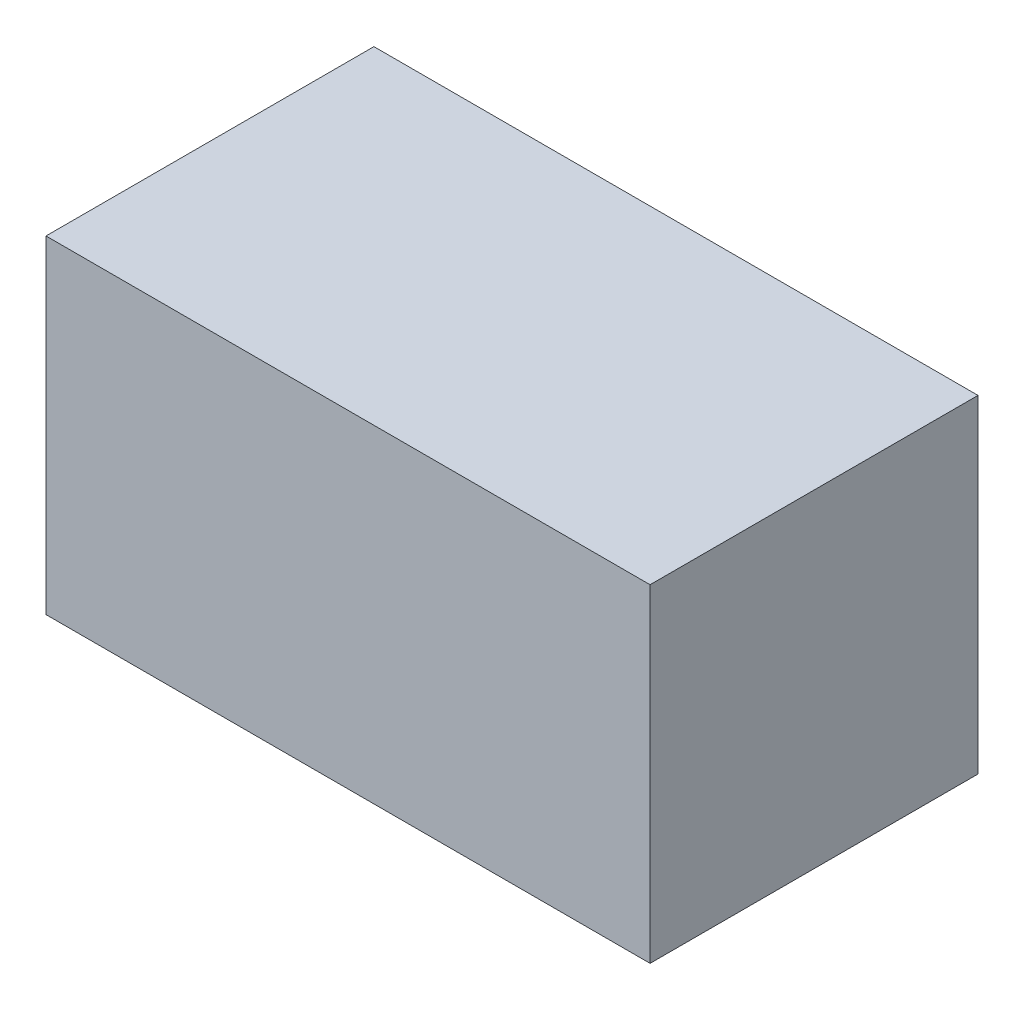
ISO-10303-21;
HEADER;
FILE_DESCRIPTION(('STEP AP214'),'2;1');
FILE_NAME('part.step','',(''),(''),'','','');
FILE_SCHEMA(('AUTOMOTIVE_DESIGN { 1 0 10303 214 1 1 1 1 }'));
ENDSEC;
DATA;
#1=APPLICATION_CONTEXT('core data for automotive mechanical design processes');
#2=APPLICATION_PROTOCOL_DEFINITION('international standard','automotive_design',2000,#1);
#3=PRODUCT_CONTEXT('',#1,'mechanical');
#4=PRODUCT('Part','Part','',(#3));
#5=PRODUCT_RELATED_PRODUCT_CATEGORY('part','',(#4));
#6=PRODUCT_DEFINITION_FORMATION('','',#4);
#7=PRODUCT_DEFINITION_CONTEXT('part definition',#1,'design');
#8=PRODUCT_DEFINITION('design','',#6,#7);
#9=PRODUCT_DEFINITION_SHAPE('','',#8);
#10=(LENGTH_UNIT() NAMED_UNIT(*) SI_UNIT(.MILLI.,.METRE.));
#11=(NAMED_UNIT(*) PLANE_ANGLE_UNIT() SI_UNIT($,.RADIAN.));
#12=(NAMED_UNIT(*) SI_UNIT($,.STERADIAN.) SOLID_ANGLE_UNIT());
#13=UNCERTAINTY_MEASURE_WITH_UNIT(LENGTH_MEASURE(1.E-05),#10,'distance_accuracy_value','');
#14=(GEOMETRIC_REPRESENTATION_CONTEXT(3) GLOBAL_UNCERTAINTY_ASSIGNED_CONTEXT((#13)) GLOBAL_UNIT_ASSIGNED_CONTEXT((#10,
#11,#12)) REPRESENTATION_CONTEXT('',''));
#15=CARTESIAN_POINT('',(0.,0.,0.));
#16=DIRECTION('',(0.,0.,1.));
#17=DIRECTION('',(1.,0.,0.));
#18=AXIS2_PLACEMENT_3D('',#15,#16,#17);
#19=CARTESIAN_POINT('',(0.87500206,-0.47500032,0.));
#20=DIRECTION('',(-1.,0.,0.));
#21=DIRECTION('',(0.,1.,0.));
#22=AXIS2_PLACEMENT_3D('',#19,#20,#21);
#23=PLANE('',#22);
#24=DIRECTION('',(0.,1.,0.));
#25=VECTOR('',#24,1.);
#26=CARTESIAN_POINT('',(0.87500206,-0.47500032,0.));
#27=LINE('',#26,#25);
#28=CARTESIAN_POINT('',(0.87500206,-0.47500032,0.));
#29=VERTEX_POINT('',#28);
#30=CARTESIAN_POINT('',(0.87500206,0.47500032,0.));
#31=VERTEX_POINT('',#30);
#32=EDGE_CURVE('E11',#29,#31,#27,.T.);
#33=ORIENTED_EDGE('',*,*,#32,.T.);
#34=DIRECTION('',(0.,0.,1.));
#35=VECTOR('',#34,1.);
#36=CARTESIAN_POINT('',(0.87500206,0.47500032,0.));
#37=LINE('',#36,#35);
#38=CARTESIAN_POINT('',(0.87500206,0.47500032,0.95000064));
#39=VERTEX_POINT('',#38);
#40=EDGE_CURVE('E24',#31,#39,#37,.T.);
#41=ORIENTED_EDGE('',*,*,#40,.T.);
#42=DIRECTION('',(0.,1.,0.));
#43=VECTOR('',#42,1.);
#44=CARTESIAN_POINT('',(0.87500206,-0.47500032,0.95000064));
#45=LINE('',#44,#43);
#46=CARTESIAN_POINT('',(0.87500206,-0.47500032,0.95000064));
#47=VERTEX_POINT('',#46);
#48=EDGE_CURVE('E87',#47,#39,#45,.T.);
#49=ORIENTED_EDGE('',*,*,#48,.F.);
#50=DIRECTION('',(0.,0.,1.));
#51=VECTOR('',#50,1.);
#52=CARTESIAN_POINT('',(0.87500206,-0.47500032,0.));
#53=LINE('',#52,#51);
#54=EDGE_CURVE('E36',#29,#47,#53,.T.);
#55=ORIENTED_EDGE('',*,*,#54,.F.);
#56=EDGE_LOOP('',(#33,#41,#49,#55));
#57=FACE_BOUND('',#56,.T.);
#58=ADVANCED_FACE('F17',(#57),#23,.F.);
#59=CARTESIAN_POINT('',(0.87500206,0.47500032,0.));
#60=DIRECTION('',(0.,-1.,0.));
#61=DIRECTION('',(-1.,0.,0.));
#62=AXIS2_PLACEMENT_3D('',#59,#60,#61);
#63=PLANE('',#62);
#64=DIRECTION('',(-1.,0.,0.));
#65=VECTOR('',#64,1.);
#66=CARTESIAN_POINT('',(0.87500206,0.47500032,0.));
#67=LINE('',#66,#65);
#68=CARTESIAN_POINT('',(-0.87499952,0.47500032,0.));
#69=VERTEX_POINT('',#68);
#70=EDGE_CURVE('E84',#31,#69,#67,.T.);
#71=ORIENTED_EDGE('',*,*,#70,.T.);
#72=DIRECTION('',(0.,0.,1.));
#73=VECTOR('',#72,1.);
#74=CARTESIAN_POINT('',(-0.87499952,0.47500032,0.));
#75=LINE('',#74,#73);
#76=CARTESIAN_POINT('',(-0.87499952,0.47500032,0.95000064));
#77=VERTEX_POINT('',#76);
#78=EDGE_CURVE('E82',#69,#77,#75,.T.);
#79=ORIENTED_EDGE('',*,*,#78,.T.);
#80=DIRECTION('',(-1.,0.,0.));
#81=VECTOR('',#80,1.);
#82=CARTESIAN_POINT('',(0.87500206,0.47500032,0.95000064));
#83=LINE('',#82,#81);
#84=EDGE_CURVE('E62',#39,#77,#83,.T.);
#85=ORIENTED_EDGE('',*,*,#84,.F.);
#86=ORIENTED_EDGE('',*,*,#40,.F.);
#87=EDGE_LOOP('',(#71,#79,#85,#86));
#88=FACE_BOUND('',#87,.T.);
#89=ADVANCED_FACE('F89',(#88),#63,.F.);
#90=CARTESIAN_POINT('',(-0.87499952,0.47500032,0.));
#91=DIRECTION('',(1.,0.,0.));
#92=DIRECTION('',(0.,-1.,0.));
#93=AXIS2_PLACEMENT_3D('',#90,#91,#92);
#94=PLANE('',#93);
#95=DIRECTION('',(0.,-1.,0.));
#96=VECTOR('',#95,1.);
#97=CARTESIAN_POINT('',(-0.87499952,0.47500032,0.));
#98=LINE('',#97,#96);
#99=CARTESIAN_POINT('',(-0.87499952,-0.47500032,0.));
#100=VERTEX_POINT('',#99);
#101=EDGE_CURVE('E71',#69,#100,#98,.T.);
#102=ORIENTED_EDGE('',*,*,#101,.T.);
#103=DIRECTION('',(0.,0.,1.));
#104=VECTOR('',#103,1.);
#105=CARTESIAN_POINT('',(-0.87499952,-0.47500032,0.));
#106=LINE('',#105,#104);
#107=CARTESIAN_POINT('',(-0.87499952,-0.47500032,0.95000064));
#108=VERTEX_POINT('',#107);
#109=EDGE_CURVE('E65',#100,#108,#106,.T.);
#110=ORIENTED_EDGE('',*,*,#109,.T.);
#111=DIRECTION('',(0.,-1.,0.));
#112=VECTOR('',#111,1.);
#113=CARTESIAN_POINT('',(-0.87499952,0.47500032,0.95000064));
#114=LINE('',#113,#112);
#115=EDGE_CURVE('E57',#77,#108,#114,.T.);
#116=ORIENTED_EDGE('',*,*,#115,.F.);
#117=ORIENTED_EDGE('',*,*,#78,.F.);
#118=EDGE_LOOP('',(#102,#110,#116,#117));
#119=FACE_BOUND('',#118,.T.);
#120=ADVANCED_FACE('F69',(#119),#94,.F.);
#121=CARTESIAN_POINT('',(-0.87499952,-0.47500032,0.));
#122=DIRECTION('',(0.,1.,0.));
#123=DIRECTION('',(1.,0.,0.));
#124=AXIS2_PLACEMENT_3D('',#121,#122,#123);
#125=PLANE('',#124);
#126=DIRECTION('',(1.,0.,0.));
#127=VECTOR('',#126,1.);
#128=CARTESIAN_POINT('',(-0.87499952,-0.47500032,0.));
#129=LINE('',#128,#127);
#130=EDGE_CURVE('E66',#100,#29,#129,.T.);
#131=ORIENTED_EDGE('',*,*,#130,.T.);
#132=ORIENTED_EDGE('',*,*,#54,.T.);
#133=DIRECTION('',(1.,0.,0.));
#134=VECTOR('',#133,1.);
#135=CARTESIAN_POINT('',(-0.87499952,-0.47500032,0.95000064));
#136=LINE('',#135,#134);
#137=EDGE_CURVE('E61',#108,#47,#136,.T.);
#138=ORIENTED_EDGE('',*,*,#137,.F.);
#139=ORIENTED_EDGE('',*,*,#109,.F.);
#140=EDGE_LOOP('',(#131,#132,#138,#139));
#141=FACE_BOUND('',#140,.T.);
#142=ADVANCED_FACE('F76',(#141),#125,.F.);
#143=CARTESIAN_POINT('',(0.87500206,-0.47500032,0.));
#144=DIRECTION('',(0.,0.,-1.));
#145=DIRECTION('',(-1.,0.,0.));
#146=AXIS2_PLACEMENT_3D('',#143,#144,#145);
#147=PLANE('',#146);
#148=ORIENTED_EDGE('',*,*,#130,.F.);
#149=ORIENTED_EDGE('',*,*,#101,.F.);
#150=ORIENTED_EDGE('',*,*,#70,.F.);
#151=ORIENTED_EDGE('',*,*,#32,.F.);
#152=EDGE_LOOP('',(#148,#149,#150,#151));
#153=FACE_BOUND('',#152,.T.);
#154=ADVANCED_FACE('F91',(#153),#147,.T.);
#155=CARTESIAN_POINT('',(0.87500206,-0.47500032,0.95000064));
#156=DIRECTION('',(0.,0.,-1.));
#157=DIRECTION('',(-1.,0.,0.));
#158=AXIS2_PLACEMENT_3D('',#155,#156,#157);
#159=PLANE('',#158);
#160=ORIENTED_EDGE('',*,*,#48,.T.);
#161=ORIENTED_EDGE('',*,*,#84,.T.);
#162=ORIENTED_EDGE('',*,*,#115,.T.);
#163=ORIENTED_EDGE('',*,*,#137,.T.);
#164=EDGE_LOOP('',(#160,#161,#162,#163));
#165=FACE_BOUND('',#164,.T.);
#166=ADVANCED_FACE('F59',(#165),#159,.F.);
#167=CLOSED_SHELL('',(#58,#89,#120,#142,#154,#166));
#168=MANIFOLD_SOLID_BREP('B1',#167);
#169=ADVANCED_BREP_SHAPE_REPRESENTATION('',(#18,#168),#14);
#170=SHAPE_DEFINITION_REPRESENTATION(#9,#169);
ENDSEC;
END-ISO-10303-21;
